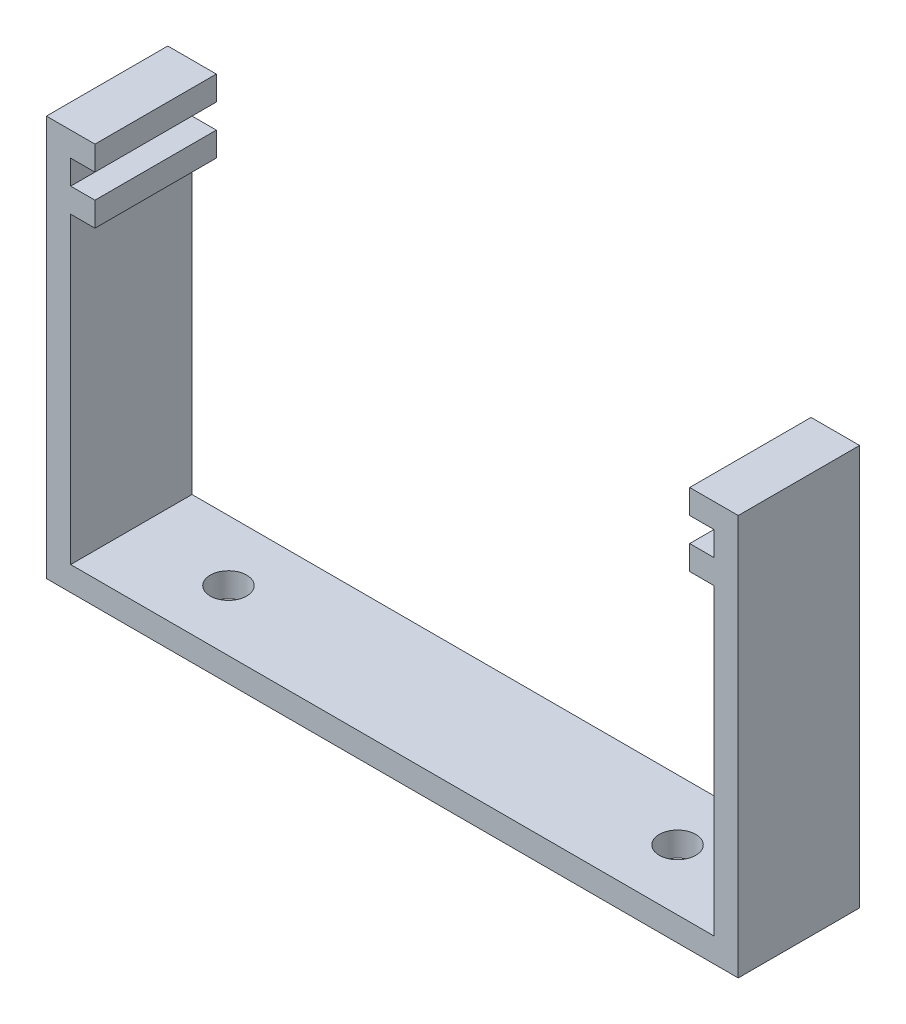
ISO-10303-21;
HEADER;
FILE_DESCRIPTION(('STEP AP214'),'2;1');
FILE_NAME('part.step','',(''),(''),'','','');
FILE_SCHEMA(('AUTOMOTIVE_DESIGN { 1 0 10303 214 1 1 1 1 }'));
ENDSEC;
DATA;
#1=APPLICATION_CONTEXT('core data for automotive mechanical design processes');
#2=APPLICATION_PROTOCOL_DEFINITION('international standard','automotive_design',2000,#1);
#3=PRODUCT_CONTEXT('',#1,'mechanical');
#4=PRODUCT('Part','Part','',(#3));
#5=PRODUCT_RELATED_PRODUCT_CATEGORY('part','',(#4));
#6=PRODUCT_DEFINITION_FORMATION('','',#4);
#7=PRODUCT_DEFINITION_CONTEXT('part definition',#1,'design');
#8=PRODUCT_DEFINITION('design','',#6,#7);
#9=PRODUCT_DEFINITION_SHAPE('','',#8);
#10=(LENGTH_UNIT() NAMED_UNIT(*) SI_UNIT(.MILLI.,.METRE.));
#11=(NAMED_UNIT(*) PLANE_ANGLE_UNIT() SI_UNIT($,.RADIAN.));
#12=(NAMED_UNIT(*) SI_UNIT($,.STERADIAN.) SOLID_ANGLE_UNIT());
#13=UNCERTAINTY_MEASURE_WITH_UNIT(LENGTH_MEASURE(1.E-05),#10,'distance_accuracy_value','');
#14=(GEOMETRIC_REPRESENTATION_CONTEXT(3) GLOBAL_UNCERTAINTY_ASSIGNED_CONTEXT((#13)) GLOBAL_UNIT_ASSIGNED_CONTEXT((#10,
#11,#12)) REPRESENTATION_CONTEXT('',''));
#15=CARTESIAN_POINT('',(0.,0.,0.));
#16=DIRECTION('',(0.,0.,1.));
#17=DIRECTION('',(1.,0.,0.));
#18=AXIS2_PLACEMENT_3D('',#15,#16,#17);
#19=CARTESIAN_POINT('',(0.,0.,10.));
#20=DIRECTION('',(-1.,0.,0.));
#21=DIRECTION('',(0.,0.,1.));
#22=AXIS2_PLACEMENT_3D('',#19,#20,#21);
#23=PLANE('',#22);
#24=DIRECTION('',(0.,1.,0.));
#25=VECTOR('',#24,1.);
#26=CARTESIAN_POINT('',(0.,0.,0.));
#27=LINE('',#26,#25);
#28=CARTESIAN_POINT('',(0.,0.,0.));
#29=VERTEX_POINT('',#28);
#30=CARTESIAN_POINT('',(0.,25.,0.));
#31=VERTEX_POINT('',#30);
#32=EDGE_CURVE('E205',#29,#31,#27,.T.);
#33=ORIENTED_EDGE('',*,*,#32,.T.);
#34=DIRECTION('',(0.,0.,-1.));
#35=VECTOR('',#34,1.);
#36=CARTESIAN_POINT('',(0.,25.,10.));
#37=LINE('',#36,#35);
#38=CARTESIAN_POINT('',(0.,25.,10.));
#39=VERTEX_POINT('',#38);
#40=EDGE_CURVE('E11',#39,#31,#37,.T.);
#41=ORIENTED_EDGE('',*,*,#40,.F.);
#42=DIRECTION('',(0.,1.,0.));
#43=VECTOR('',#42,1.);
#44=CARTESIAN_POINT('',(0.,0.,10.));
#45=LINE('',#44,#43);
#46=CARTESIAN_POINT('',(0.,0.,10.));
#47=VERTEX_POINT('',#46);
#48=EDGE_CURVE('E243',#47,#39,#45,.T.);
#49=ORIENTED_EDGE('',*,*,#48,.F.);
#50=DIRECTION('',(0.,0.,-1.));
#51=VECTOR('',#50,1.);
#52=CARTESIAN_POINT('',(0.,0.,10.));
#53=LINE('',#52,#51);
#54=EDGE_CURVE('E201',#47,#29,#53,.T.);
#55=ORIENTED_EDGE('',*,*,#54,.T.);
#56=EDGE_LOOP('',(#33,#41,#49,#55));
#57=FACE_BOUND('',#56,.T.);
#58=ADVANCED_FACE('F35',(#57),#23,.F.);
#59=CARTESIAN_POINT('',(0.,25.,10.));
#60=DIRECTION('',(0.,1.,0.));
#61=DIRECTION('',(0.,0.,1.));
#62=AXIS2_PLACEMENT_3D('',#59,#60,#61);
#63=PLANE('',#62);
#64=DIRECTION('',(1.,0.,0.));
#65=VECTOR('',#64,1.);
#66=CARTESIAN_POINT('',(0.,25.,0.));
#67=LINE('',#66,#65);
#68=CARTESIAN_POINT('',(2.,25.,0.));
#69=VERTEX_POINT('',#68);
#70=EDGE_CURVE('E208',#31,#69,#67,.T.);
#71=ORIENTED_EDGE('',*,*,#70,.T.);
#72=DIRECTION('',(0.,0.,-1.));
#73=VECTOR('',#72,1.);
#74=CARTESIAN_POINT('',(2.,25.,10.));
#75=LINE('',#74,#73);
#76=CARTESIAN_POINT('',(2.,25.,10.));
#77=VERTEX_POINT('',#76);
#78=EDGE_CURVE('E44',#77,#69,#75,.T.);
#79=ORIENTED_EDGE('',*,*,#78,.F.);
#80=DIRECTION('',(1.,0.,0.));
#81=VECTOR('',#80,1.);
#82=CARTESIAN_POINT('',(0.,25.,10.));
#83=LINE('',#82,#81);
#84=EDGE_CURVE('E132',#39,#77,#83,.T.);
#85=ORIENTED_EDGE('',*,*,#84,.F.);
#86=ORIENTED_EDGE('',*,*,#40,.T.);
#87=EDGE_LOOP('',(#71,#79,#85,#86));
#88=FACE_BOUND('',#87,.T.);
#89=ADVANCED_FACE('F362',(#88),#63,.F.);
#90=CARTESIAN_POINT('',(2.,25.,10.));
#91=DIRECTION('',(-1.,0.,0.));
#92=DIRECTION('',(0.,0.,1.));
#93=AXIS2_PLACEMENT_3D('',#90,#91,#92);
#94=PLANE('',#93);
#95=DIRECTION('',(0.,1.,0.));
#96=VECTOR('',#95,1.);
#97=CARTESIAN_POINT('',(2.,25.,0.));
#98=LINE('',#97,#96);
#99=CARTESIAN_POINT('',(2.,27.,0.));
#100=VERTEX_POINT('',#99);
#101=EDGE_CURVE('E210',#69,#100,#98,.T.);
#102=ORIENTED_EDGE('',*,*,#101,.T.);
#103=DIRECTION('',(0.,0.,-1.));
#104=VECTOR('',#103,1.);
#105=CARTESIAN_POINT('',(2.,27.,10.));
#106=LINE('',#105,#104);
#107=CARTESIAN_POINT('',(2.,27.,10.));
#108=VERTEX_POINT('',#107);
#109=EDGE_CURVE('E286',#108,#100,#106,.T.);
#110=ORIENTED_EDGE('',*,*,#109,.F.);
#111=DIRECTION('',(0.,1.,0.));
#112=VECTOR('',#111,1.);
#113=CARTESIAN_POINT('',(2.,25.,10.));
#114=LINE('',#113,#112);
#115=EDGE_CURVE('E306',#77,#108,#114,.T.);
#116=ORIENTED_EDGE('',*,*,#115,.F.);
#117=ORIENTED_EDGE('',*,*,#78,.T.);
#118=EDGE_LOOP('',(#102,#110,#116,#117));
#119=FACE_BOUND('',#118,.T.);
#120=ADVANCED_FACE('F366',(#119),#94,.F.);
#121=CARTESIAN_POINT('',(2.,27.,10.));
#122=DIRECTION('',(0.,-1.,0.));
#123=DIRECTION('',(0.,0.,-1.));
#124=AXIS2_PLACEMENT_3D('',#121,#122,#123);
#125=PLANE('',#124);
#126=DIRECTION('',(-1.,0.,0.));
#127=VECTOR('',#126,1.);
#128=CARTESIAN_POINT('',(2.,27.,0.));
#129=LINE('',#128,#127);
#130=CARTESIAN_POINT('',(0.,27.,0.));
#131=VERTEX_POINT('',#130);
#132=EDGE_CURVE('E212',#100,#131,#129,.T.);
#133=ORIENTED_EDGE('',*,*,#132,.T.);
#134=DIRECTION('',(0.,0.,-1.));
#135=VECTOR('',#134,1.);
#136=CARTESIAN_POINT('',(0.,27.,10.));
#137=LINE('',#136,#135);
#138=CARTESIAN_POINT('',(0.,27.,10.));
#139=VERTEX_POINT('',#138);
#140=EDGE_CURVE('E283',#139,#131,#137,.T.);
#141=ORIENTED_EDGE('',*,*,#140,.F.);
#142=DIRECTION('',(-1.,0.,0.));
#143=VECTOR('',#142,1.);
#144=CARTESIAN_POINT('',(2.,27.,10.));
#145=LINE('',#144,#143);
#146=EDGE_CURVE('E308',#108,#139,#145,.T.);
#147=ORIENTED_EDGE('',*,*,#146,.F.);
#148=ORIENTED_EDGE('',*,*,#109,.T.);
#149=EDGE_LOOP('',(#133,#141,#147,#148));
#150=FACE_BOUND('',#149,.T.);
#151=ADVANCED_FACE('F370',(#150),#125,.F.);
#152=CARTESIAN_POINT('',(0.,27.,10.));
#153=DIRECTION('',(-1.,0.,0.));
#154=DIRECTION('',(0.,0.,1.));
#155=AXIS2_PLACEMENT_3D('',#152,#153,#154);
#156=PLANE('',#155);
#157=DIRECTION('',(0.,1.,0.));
#158=VECTOR('',#157,1.);
#159=CARTESIAN_POINT('',(0.,27.,0.));
#160=LINE('',#159,#158);
#161=CARTESIAN_POINT('',(0.,29.,0.));
#162=VERTEX_POINT('',#161);
#163=EDGE_CURVE('E214',#131,#162,#160,.T.);
#164=ORIENTED_EDGE('',*,*,#163,.T.);
#165=DIRECTION('',(0.,0.,-1.));
#166=VECTOR('',#165,1.);
#167=CARTESIAN_POINT('',(0.,29.,10.));
#168=LINE('',#167,#166);
#169=CARTESIAN_POINT('',(0.,29.,10.));
#170=VERTEX_POINT('',#169);
#171=EDGE_CURVE('E280',#170,#162,#168,.T.);
#172=ORIENTED_EDGE('',*,*,#171,.F.);
#173=DIRECTION('',(0.,1.,0.));
#174=VECTOR('',#173,1.);
#175=CARTESIAN_POINT('',(0.,27.,10.));
#176=LINE('',#175,#174);
#177=EDGE_CURVE('E310',#139,#170,#176,.T.);
#178=ORIENTED_EDGE('',*,*,#177,.F.);
#179=ORIENTED_EDGE('',*,*,#140,.T.);
#180=EDGE_LOOP('',(#164,#172,#178,#179));
#181=FACE_BOUND('',#180,.T.);
#182=ADVANCED_FACE('F376',(#181),#156,.F.);
#183=CARTESIAN_POINT('',(0.,29.,10.));
#184=DIRECTION('',(0.,1.,0.));
#185=DIRECTION('',(0.,0.,1.));
#186=AXIS2_PLACEMENT_3D('',#183,#184,#185);
#187=PLANE('',#186);
#188=DIRECTION('',(1.,0.,0.));
#189=VECTOR('',#188,1.);
#190=CARTESIAN_POINT('',(0.,29.,0.));
#191=LINE('',#190,#189);
#192=CARTESIAN_POINT('',(2.,29.,0.));
#193=VERTEX_POINT('',#192);
#194=EDGE_CURVE('E216',#162,#193,#191,.T.);
#195=ORIENTED_EDGE('',*,*,#194,.T.);
#196=DIRECTION('',(0.,0.,-1.));
#197=VECTOR('',#196,1.);
#198=CARTESIAN_POINT('',(2.,29.,10.));
#199=LINE('',#198,#197);
#200=CARTESIAN_POINT('',(2.,29.,10.));
#201=VERTEX_POINT('',#200);
#202=EDGE_CURVE('E277',#201,#193,#199,.T.);
#203=ORIENTED_EDGE('',*,*,#202,.F.);
#204=DIRECTION('',(1.,0.,0.));
#205=VECTOR('',#204,1.);
#206=CARTESIAN_POINT('',(0.,29.,10.));
#207=LINE('',#206,#205);
#208=EDGE_CURVE('E312',#170,#201,#207,.T.);
#209=ORIENTED_EDGE('',*,*,#208,.F.);
#210=ORIENTED_EDGE('',*,*,#171,.T.);
#211=EDGE_LOOP('',(#195,#203,#209,#210));
#212=FACE_BOUND('',#211,.T.);
#213=ADVANCED_FACE('F380',(#212),#187,.F.);
#214=CARTESIAN_POINT('',(2.,29.,10.));
#215=DIRECTION('',(-1.,0.,0.));
#216=DIRECTION('',(0.,0.,1.));
#217=AXIS2_PLACEMENT_3D('',#214,#215,#216);
#218=PLANE('',#217);
#219=DIRECTION('',(0.,1.,0.));
#220=VECTOR('',#219,1.);
#221=CARTESIAN_POINT('',(2.,29.,0.));
#222=LINE('',#221,#220);
#223=CARTESIAN_POINT('',(2.,31.,0.));
#224=VERTEX_POINT('',#223);
#225=EDGE_CURVE('E218',#193,#224,#222,.T.);
#226=ORIENTED_EDGE('',*,*,#225,.T.);
#227=DIRECTION('',(0.,0.,-1.));
#228=VECTOR('',#227,1.);
#229=CARTESIAN_POINT('',(2.,31.,10.));
#230=LINE('',#229,#228);
#231=CARTESIAN_POINT('',(2.,31.,10.));
#232=VERTEX_POINT('',#231);
#233=EDGE_CURVE('E274',#232,#224,#230,.T.);
#234=ORIENTED_EDGE('',*,*,#233,.F.);
#235=DIRECTION('',(0.,1.,0.));
#236=VECTOR('',#235,1.);
#237=CARTESIAN_POINT('',(2.,29.,10.));
#238=LINE('',#237,#236);
#239=EDGE_CURVE('E314',#201,#232,#238,.T.);
#240=ORIENTED_EDGE('',*,*,#239,.F.);
#241=ORIENTED_EDGE('',*,*,#202,.T.);
#242=EDGE_LOOP('',(#226,#234,#240,#241));
#243=FACE_BOUND('',#242,.T.);
#244=ADVANCED_FACE('F384',(#243),#218,.F.);
#245=CARTESIAN_POINT('',(2.,31.,10.));
#246=DIRECTION('',(0.,-1.,0.));
#247=DIRECTION('',(0.,0.,-1.));
#248=AXIS2_PLACEMENT_3D('',#245,#246,#247);
#249=PLANE('',#248);
#250=DIRECTION('',(-1.,0.,0.));
#251=VECTOR('',#250,1.);
#252=CARTESIAN_POINT('',(2.,31.,0.));
#253=LINE('',#252,#251);
#254=CARTESIAN_POINT('',(-1.99999999999999,31.,0.));
#255=VERTEX_POINT('',#254);
#256=EDGE_CURVE('E220',#224,#255,#253,.T.);
#257=ORIENTED_EDGE('',*,*,#256,.T.);
#258=DIRECTION('',(0.,0.,-1.));
#259=VECTOR('',#258,1.);
#260=CARTESIAN_POINT('',(-1.99999999999999,31.,10.));
#261=LINE('',#260,#259);
#262=CARTESIAN_POINT('',(-1.99999999999999,31.,10.));
#263=VERTEX_POINT('',#262);
#264=EDGE_CURVE('E271',#263,#255,#261,.T.);
#265=ORIENTED_EDGE('',*,*,#264,.F.);
#266=DIRECTION('',(-1.,0.,0.));
#267=VECTOR('',#266,1.);
#268=CARTESIAN_POINT('',(2.,31.,10.));
#269=LINE('',#268,#267);
#270=EDGE_CURVE('E316',#232,#263,#269,.T.);
#271=ORIENTED_EDGE('',*,*,#270,.F.);
#272=ORIENTED_EDGE('',*,*,#233,.T.);
#273=EDGE_LOOP('',(#257,#265,#271,#272));
#274=FACE_BOUND('',#273,.T.);
#275=ADVANCED_FACE('F388',(#274),#249,.F.);
#276=CARTESIAN_POINT('',(-1.99999999999999,31.,10.));
#277=DIRECTION('',(1.,0.,0.));
#278=DIRECTION('',(0.,1.,0.));
#279=AXIS2_PLACEMENT_3D('',#276,#277,#278);
#280=PLANE('',#279);
#281=DIRECTION('',(0.,-1.,0.));
#282=VECTOR('',#281,1.);
#283=CARTESIAN_POINT('',(-1.99999999999999,31.,0.));
#284=LINE('',#283,#282);
#285=CARTESIAN_POINT('',(-2.,-2.,0.));
#286=VERTEX_POINT('',#285);
#287=EDGE_CURVE('E222',#255,#286,#284,.T.);
#288=ORIENTED_EDGE('',*,*,#287,.T.);
#289=DIRECTION('',(0.,0.,-1.));
#290=VECTOR('',#289,1.);
#291=CARTESIAN_POINT('',(-2.,-2.,10.));
#292=LINE('',#291,#290);
#293=CARTESIAN_POINT('',(-2.,-2.,10.));
#294=VERTEX_POINT('',#293);
#295=EDGE_CURVE('E268',#294,#286,#292,.T.);
#296=ORIENTED_EDGE('',*,*,#295,.F.);
#297=DIRECTION('',(0.,-1.,0.));
#298=VECTOR('',#297,1.);
#299=CARTESIAN_POINT('',(-1.99999999999999,31.,10.));
#300=LINE('',#299,#298);
#301=EDGE_CURVE('E318',#263,#294,#300,.T.);
#302=ORIENTED_EDGE('',*,*,#301,.F.);
#303=ORIENTED_EDGE('',*,*,#264,.T.);
#304=EDGE_LOOP('',(#288,#296,#302,#303));
#305=FACE_BOUND('',#304,.T.);
#306=ADVANCED_FACE('F392',(#305),#280,.F.);
#307=CARTESIAN_POINT('',(55.,-2.,10.));
#308=DIRECTION('',(0.,1.,0.));
#309=DIRECTION('',(0.,0.,1.));
#310=AXIS2_PLACEMENT_3D('',#307,#308,#309);
#311=PLANE('',#310);
#312=CARTESIAN_POINT('',(45.,-2.,5.));
#313=DIRECTION('',(0.,-1.,0.));
#314=DIRECTION('',(0.,0.,-1.));
#315=AXIS2_PLACEMENT_3D('',#312,#313,#314);
#316=CIRCLE('',#315,1.5);
#317=CARTESIAN_POINT('',(45.,-2.,3.5));
#318=VERTEX_POINT('',#317);
#319=EDGE_CURVE('E292',#318,#318,#316,.T.);
#320=ORIENTED_EDGE('',*,*,#319,.F.);
#321=EDGE_LOOP('',(#320));
#322=FACE_BOUND('',#321,.T.);
#323=CARTESIAN_POINT('',(8.,-2.,5.));
#324=DIRECTION('',(0.,-1.,0.));
#325=DIRECTION('',(0.,0.,-1.));
#326=AXIS2_PLACEMENT_3D('',#323,#324,#325);
#327=CIRCLE('',#326,1.5);
#328=CARTESIAN_POINT('',(8.,-2.,3.5));
#329=VERTEX_POINT('',#328);
#330=EDGE_CURVE('E297',#329,#329,#327,.T.);
#331=ORIENTED_EDGE('',*,*,#330,.F.);
#332=EDGE_LOOP('',(#331));
#333=FACE_BOUND('',#332,.T.);
#334=DIRECTION('',(1.,0.,0.));
#335=VECTOR('',#334,1.);
#336=CARTESIAN_POINT('',(55.,-2.,0.));
#337=LINE('',#336,#335);
#338=CARTESIAN_POINT('',(55.,-2.,0.));
#339=VERTEX_POINT('',#338);
#340=EDGE_CURVE('E224',#286,#339,#337,.T.);
#341=ORIENTED_EDGE('',*,*,#340,.T.);
#342=DIRECTION('',(0.,0.,-1.));
#343=VECTOR('',#342,1.);
#344=CARTESIAN_POINT('',(55.,-2.,10.));
#345=LINE('',#344,#343);
#346=CARTESIAN_POINT('',(55.,-2.,10.));
#347=VERTEX_POINT('',#346);
#348=EDGE_CURVE('E265',#347,#339,#345,.T.);
#349=ORIENTED_EDGE('',*,*,#348,.F.);
#350=DIRECTION('',(1.,0.,0.));
#351=VECTOR('',#350,1.);
#352=CARTESIAN_POINT('',(55.,-2.,10.));
#353=LINE('',#352,#351);
#354=EDGE_CURVE('E320',#294,#347,#353,.T.);
#355=ORIENTED_EDGE('',*,*,#354,.F.);
#356=ORIENTED_EDGE('',*,*,#295,.T.);
#357=EDGE_LOOP('',(#341,#349,#355,#356));
#358=FACE_BOUND('',#357,.T.);
#359=ADVANCED_FACE('F396',(#322,#333,#358),#311,.F.);
#360=CARTESIAN_POINT('',(55.,31.,10.));
#361=DIRECTION('',(-1.,0.,0.));
#362=DIRECTION('',(0.,-1.,0.));
#363=AXIS2_PLACEMENT_3D('',#360,#361,#362);
#364=PLANE('',#363);
#365=DIRECTION('',(0.,1.,0.));
#366=VECTOR('',#365,1.);
#367=CARTESIAN_POINT('',(55.,31.,0.));
#368=LINE('',#367,#366);
#369=CARTESIAN_POINT('',(55.,31.,0.));
#370=VERTEX_POINT('',#369);
#371=EDGE_CURVE('E226',#339,#370,#368,.T.);
#372=ORIENTED_EDGE('',*,*,#371,.T.);
#373=DIRECTION('',(0.,0.,-1.));
#374=VECTOR('',#373,1.);
#375=CARTESIAN_POINT('',(55.,31.,10.));
#376=LINE('',#375,#374);
#377=CARTESIAN_POINT('',(55.,31.,10.));
#378=VERTEX_POINT('',#377);
#379=EDGE_CURVE('E262',#378,#370,#376,.T.);
#380=ORIENTED_EDGE('',*,*,#379,.F.);
#381=DIRECTION('',(0.,1.,0.));
#382=VECTOR('',#381,1.);
#383=CARTESIAN_POINT('',(55.,31.,10.));
#384=LINE('',#383,#382);
#385=EDGE_CURVE('E322',#347,#378,#384,.T.);
#386=ORIENTED_EDGE('',*,*,#385,.F.);
#387=ORIENTED_EDGE('',*,*,#348,.T.);
#388=EDGE_LOOP('',(#372,#380,#386,#387));
#389=FACE_BOUND('',#388,.T.);
#390=ADVANCED_FACE('F400',(#389),#364,.F.);
#391=CARTESIAN_POINT('',(51.,31.,10.));
#392=DIRECTION('',(0.,-1.,0.));
#393=DIRECTION('',(0.,0.,-1.));
#394=AXIS2_PLACEMENT_3D('',#391,#392,#393);
#395=PLANE('',#394);
#396=DIRECTION('',(-1.,0.,0.));
#397=VECTOR('',#396,1.);
#398=CARTESIAN_POINT('',(51.,31.,0.));
#399=LINE('',#398,#397);
#400=CARTESIAN_POINT('',(51.,31.,0.));
#401=VERTEX_POINT('',#400);
#402=EDGE_CURVE('E228',#370,#401,#399,.T.);
#403=ORIENTED_EDGE('',*,*,#402,.T.);
#404=DIRECTION('',(0.,0.,-1.));
#405=VECTOR('',#404,1.);
#406=CARTESIAN_POINT('',(51.,31.,10.));
#407=LINE('',#406,#405);
#408=CARTESIAN_POINT('',(51.,31.,10.));
#409=VERTEX_POINT('',#408);
#410=EDGE_CURVE('E259',#409,#401,#407,.T.);
#411=ORIENTED_EDGE('',*,*,#410,.F.);
#412=DIRECTION('',(-1.,0.,0.));
#413=VECTOR('',#412,1.);
#414=CARTESIAN_POINT('',(51.,31.,10.));
#415=LINE('',#414,#413);
#416=EDGE_CURVE('E324',#378,#409,#415,.T.);
#417=ORIENTED_EDGE('',*,*,#416,.F.);
#418=ORIENTED_EDGE('',*,*,#379,.T.);
#419=EDGE_LOOP('',(#403,#411,#417,#418));
#420=FACE_BOUND('',#419,.T.);
#421=ADVANCED_FACE('F404',(#420),#395,.F.);
#422=CARTESIAN_POINT('',(51.,29.,10.));
#423=DIRECTION('',(1.,0.,0.));
#424=DIRECTION('',(0.,0.,-1.));
#425=AXIS2_PLACEMENT_3D('',#422,#423,#424);
#426=PLANE('',#425);
#427=DIRECTION('',(0.,-1.,0.));
#428=VECTOR('',#427,1.);
#429=CARTESIAN_POINT('',(51.,29.,0.));
#430=LINE('',#429,#428);
#431=CARTESIAN_POINT('',(51.,29.,0.));
#432=VERTEX_POINT('',#431);
#433=EDGE_CURVE('E230',#401,#432,#430,.T.);
#434=ORIENTED_EDGE('',*,*,#433,.T.);
#435=DIRECTION('',(0.,0.,-1.));
#436=VECTOR('',#435,1.);
#437=CARTESIAN_POINT('',(51.,29.,10.));
#438=LINE('',#437,#436);
#439=CARTESIAN_POINT('',(51.,29.,10.));
#440=VERTEX_POINT('',#439);
#441=EDGE_CURVE('E256',#440,#432,#438,.T.);
#442=ORIENTED_EDGE('',*,*,#441,.F.);
#443=DIRECTION('',(0.,-1.,0.));
#444=VECTOR('',#443,1.);
#445=CARTESIAN_POINT('',(51.,29.,10.));
#446=LINE('',#445,#444);
#447=EDGE_CURVE('E326',#409,#440,#446,.T.);
#448=ORIENTED_EDGE('',*,*,#447,.F.);
#449=ORIENTED_EDGE('',*,*,#410,.T.);
#450=EDGE_LOOP('',(#434,#442,#448,#449));
#451=FACE_BOUND('',#450,.T.);
#452=ADVANCED_FACE('F408',(#451),#426,.F.);
#453=CARTESIAN_POINT('',(53.,29.,10.));
#454=DIRECTION('',(0.,1.,0.));
#455=DIRECTION('',(0.,0.,1.));
#456=AXIS2_PLACEMENT_3D('',#453,#454,#455);
#457=PLANE('',#456);
#458=DIRECTION('',(1.,0.,0.));
#459=VECTOR('',#458,1.);
#460=CARTESIAN_POINT('',(53.,29.,0.));
#461=LINE('',#460,#459);
#462=CARTESIAN_POINT('',(53.,29.,0.));
#463=VERTEX_POINT('',#462);
#464=EDGE_CURVE('E232',#432,#463,#461,.T.);
#465=ORIENTED_EDGE('',*,*,#464,.T.);
#466=DIRECTION('',(0.,0.,-1.));
#467=VECTOR('',#466,1.);
#468=CARTESIAN_POINT('',(53.,29.,10.));
#469=LINE('',#468,#467);
#470=CARTESIAN_POINT('',(53.,29.,10.));
#471=VERTEX_POINT('',#470);
#472=EDGE_CURVE('E253',#471,#463,#469,.T.);
#473=ORIENTED_EDGE('',*,*,#472,.F.);
#474=DIRECTION('',(1.,0.,0.));
#475=VECTOR('',#474,1.);
#476=CARTESIAN_POINT('',(53.,29.,10.));
#477=LINE('',#476,#475);
#478=EDGE_CURVE('E328',#440,#471,#477,.T.);
#479=ORIENTED_EDGE('',*,*,#478,.F.);
#480=ORIENTED_EDGE('',*,*,#441,.T.);
#481=EDGE_LOOP('',(#465,#473,#479,#480));
#482=FACE_BOUND('',#481,.T.);
#483=ADVANCED_FACE('F412',(#482),#457,.F.);
#484=CARTESIAN_POINT('',(53.,27.,10.));
#485=DIRECTION('',(1.,0.,0.));
#486=DIRECTION('',(0.,0.,-1.));
#487=AXIS2_PLACEMENT_3D('',#484,#485,#486);
#488=PLANE('',#487);
#489=DIRECTION('',(0.,-1.,0.));
#490=VECTOR('',#489,1.);
#491=CARTESIAN_POINT('',(53.,27.,0.));
#492=LINE('',#491,#490);
#493=CARTESIAN_POINT('',(53.,27.,0.));
#494=VERTEX_POINT('',#493);
#495=EDGE_CURVE('E234',#463,#494,#492,.T.);
#496=ORIENTED_EDGE('',*,*,#495,.T.);
#497=DIRECTION('',(0.,0.,-1.));
#498=VECTOR('',#497,1.);
#499=CARTESIAN_POINT('',(53.,27.,10.));
#500=LINE('',#499,#498);
#501=CARTESIAN_POINT('',(53.,27.,10.));
#502=VERTEX_POINT('',#501);
#503=EDGE_CURVE('E250',#502,#494,#500,.T.);
#504=ORIENTED_EDGE('',*,*,#503,.F.);
#505=DIRECTION('',(0.,-1.,0.));
#506=VECTOR('',#505,1.);
#507=CARTESIAN_POINT('',(53.,27.,10.));
#508=LINE('',#507,#506);
#509=EDGE_CURVE('E330',#471,#502,#508,.T.);
#510=ORIENTED_EDGE('',*,*,#509,.F.);
#511=ORIENTED_EDGE('',*,*,#472,.T.);
#512=EDGE_LOOP('',(#496,#504,#510,#511));
#513=FACE_BOUND('',#512,.T.);
#514=ADVANCED_FACE('F416',(#513),#488,.F.);
#515=CARTESIAN_POINT('',(51.,27.,10.));
#516=DIRECTION('',(0.,-1.,0.));
#517=DIRECTION('',(0.,0.,-1.));
#518=AXIS2_PLACEMENT_3D('',#515,#516,#517);
#519=PLANE('',#518);
#520=DIRECTION('',(-1.,0.,0.));
#521=VECTOR('',#520,1.);
#522=CARTESIAN_POINT('',(51.,27.,0.));
#523=LINE('',#522,#521);
#524=CARTESIAN_POINT('',(51.,27.,0.));
#525=VERTEX_POINT('',#524);
#526=EDGE_CURVE('E236',#494,#525,#523,.T.);
#527=ORIENTED_EDGE('',*,*,#526,.T.);
#528=DIRECTION('',(0.,0.,-1.));
#529=VECTOR('',#528,1.);
#530=CARTESIAN_POINT('',(51.,27.,10.));
#531=LINE('',#530,#529);
#532=CARTESIAN_POINT('',(51.,27.,10.));
#533=VERTEX_POINT('',#532);
#534=EDGE_CURVE('E247',#533,#525,#531,.T.);
#535=ORIENTED_EDGE('',*,*,#534,.F.);
#536=DIRECTION('',(-1.,0.,0.));
#537=VECTOR('',#536,1.);
#538=CARTESIAN_POINT('',(51.,27.,10.));
#539=LINE('',#538,#537);
#540=EDGE_CURVE('E332',#502,#533,#539,.T.);
#541=ORIENTED_EDGE('',*,*,#540,.F.);
#542=ORIENTED_EDGE('',*,*,#503,.T.);
#543=EDGE_LOOP('',(#527,#535,#541,#542));
#544=FACE_BOUND('',#543,.T.);
#545=ADVANCED_FACE('F338',(#544),#519,.F.);
#546=CARTESIAN_POINT('',(51.,25.,10.));
#547=DIRECTION('',(1.,0.,0.));
#548=DIRECTION('',(0.,0.,-1.));
#549=AXIS2_PLACEMENT_3D('',#546,#547,#548);
#550=PLANE('',#549);
#551=DIRECTION('',(0.,-1.,0.));
#552=VECTOR('',#551,1.);
#553=CARTESIAN_POINT('',(51.,25.,0.));
#554=LINE('',#553,#552);
#555=CARTESIAN_POINT('',(51.,25.,0.));
#556=VERTEX_POINT('',#555);
#557=EDGE_CURVE('E238',#525,#556,#554,.T.);
#558=ORIENTED_EDGE('',*,*,#557,.T.);
#559=DIRECTION('',(0.,0.,-1.));
#560=VECTOR('',#559,1.);
#561=CARTESIAN_POINT('',(51.,25.,10.));
#562=LINE('',#561,#560);
#563=CARTESIAN_POINT('',(51.,25.,10.));
#564=VERTEX_POINT('',#563);
#565=EDGE_CURVE('E196',#564,#556,#562,.T.);
#566=ORIENTED_EDGE('',*,*,#565,.F.);
#567=DIRECTION('',(0.,-1.,0.));
#568=VECTOR('',#567,1.);
#569=CARTESIAN_POINT('',(51.,25.,10.));
#570=LINE('',#569,#568);
#571=EDGE_CURVE('E187',#533,#564,#570,.T.);
#572=ORIENTED_EDGE('',*,*,#571,.F.);
#573=ORIENTED_EDGE('',*,*,#534,.T.);
#574=EDGE_LOOP('',(#558,#566,#572,#573));
#575=FACE_BOUND('',#574,.T.);
#576=ADVANCED_FACE('F342',(#575),#550,.F.);
#577=CARTESIAN_POINT('',(53.,25.,10.));
#578=DIRECTION('',(0.,1.,0.));
#579=DIRECTION('',(0.,0.,1.));
#580=AXIS2_PLACEMENT_3D('',#577,#578,#579);
#581=PLANE('',#580);
#582=DIRECTION('',(1.,0.,0.));
#583=VECTOR('',#582,1.);
#584=CARTESIAN_POINT('',(53.,25.,0.));
#585=LINE('',#584,#583);
#586=CARTESIAN_POINT('',(53.,25.,0.));
#587=VERTEX_POINT('',#586);
#588=EDGE_CURVE('E195',#556,#587,#585,.T.);
#589=ORIENTED_EDGE('',*,*,#588,.T.);
#590=DIRECTION('',(0.,0.,-1.));
#591=VECTOR('',#590,1.);
#592=CARTESIAN_POINT('',(53.,25.,10.));
#593=LINE('',#592,#591);
#594=CARTESIAN_POINT('',(53.,25.,10.));
#595=VERTEX_POINT('',#594);
#596=EDGE_CURVE('E192',#595,#587,#593,.T.);
#597=ORIENTED_EDGE('',*,*,#596,.F.);
#598=DIRECTION('',(1.,0.,0.));
#599=VECTOR('',#598,1.);
#600=CARTESIAN_POINT('',(53.,25.,10.));
#601=LINE('',#600,#599);
#602=EDGE_CURVE('E181',#564,#595,#601,.T.);
#603=ORIENTED_EDGE('',*,*,#602,.F.);
#604=ORIENTED_EDGE('',*,*,#565,.T.);
#605=EDGE_LOOP('',(#589,#597,#603,#604));
#606=FACE_BOUND('',#605,.T.);
#607=ADVANCED_FACE('F193',(#606),#581,.F.);
#608=CARTESIAN_POINT('',(53.,0.,10.));
#609=DIRECTION('',(1.,0.,0.));
#610=DIRECTION('',(0.,0.,-1.));
#611=AXIS2_PLACEMENT_3D('',#608,#609,#610);
#612=PLANE('',#611);
#613=DIRECTION('',(0.,-1.,0.));
#614=VECTOR('',#613,1.);
#615=CARTESIAN_POINT('',(53.,0.,0.));
#616=LINE('',#615,#614);
#617=CARTESIAN_POINT('',(53.,0.,0.));
#618=VERTEX_POINT('',#617);
#619=EDGE_CURVE('E118',#587,#618,#616,.T.);
#620=ORIENTED_EDGE('',*,*,#619,.T.);
#621=DIRECTION('',(0.,0.,-1.));
#622=VECTOR('',#621,1.);
#623=CARTESIAN_POINT('',(53.,0.,10.));
#624=LINE('',#623,#622);
#625=CARTESIAN_POINT('',(53.,0.,10.));
#626=VERTEX_POINT('',#625);
#627=EDGE_CURVE('E197',#626,#618,#624,.T.);
#628=ORIENTED_EDGE('',*,*,#627,.F.);
#629=DIRECTION('',(0.,-1.,0.));
#630=VECTOR('',#629,1.);
#631=CARTESIAN_POINT('',(53.,0.,10.));
#632=LINE('',#631,#630);
#633=EDGE_CURVE('E185',#595,#626,#632,.T.);
#634=ORIENTED_EDGE('',*,*,#633,.F.);
#635=ORIENTED_EDGE('',*,*,#596,.T.);
#636=EDGE_LOOP('',(#620,#628,#634,#635));
#637=FACE_BOUND('',#636,.T.);
#638=ADVANCED_FACE('F199',(#637),#612,.F.);
#639=CARTESIAN_POINT('',(0.,0.,10.));
#640=DIRECTION('',(0.,-1.,0.));
#641=DIRECTION('',(0.,0.,-1.));
#642=AXIS2_PLACEMENT_3D('',#639,#640,#641);
#643=PLANE('',#642);
#644=CARTESIAN_POINT('',(45.,0.,5.));
#645=DIRECTION('',(0.,-1.,0.));
#646=DIRECTION('',(0.,0.,-1.));
#647=AXIS2_PLACEMENT_3D('',#644,#645,#646);
#648=CIRCLE('',#647,1.5);
#649=CARTESIAN_POINT('',(45.,0.,3.5));
#650=VERTEX_POINT('',#649);
#651=EDGE_CURVE('E38',#650,#650,#648,.T.);
#652=ORIENTED_EDGE('',*,*,#651,.T.);
#653=EDGE_LOOP('',(#652));
#654=FACE_BOUND('',#653,.T.);
#655=CARTESIAN_POINT('',(8.,0.,5.));
#656=DIRECTION('',(0.,-1.,0.));
#657=DIRECTION('',(0.,0.,-1.));
#658=AXIS2_PLACEMENT_3D('',#655,#656,#657);
#659=CIRCLE('',#658,1.5);
#660=CARTESIAN_POINT('',(8.,0.,3.5));
#661=VERTEX_POINT('',#660);
#662=EDGE_CURVE('E290',#661,#661,#659,.T.);
#663=ORIENTED_EDGE('',*,*,#662,.T.);
#664=EDGE_LOOP('',(#663));
#665=FACE_BOUND('',#664,.T.);
#666=DIRECTION('',(-1.,0.,0.));
#667=VECTOR('',#666,1.);
#668=CARTESIAN_POINT('',(0.,0.,0.));
#669=LINE('',#668,#667);
#670=EDGE_CURVE('E124',#618,#29,#669,.T.);
#671=ORIENTED_EDGE('',*,*,#670,.T.);
#672=ORIENTED_EDGE('',*,*,#54,.F.);
#673=DIRECTION('',(-1.,0.,0.));
#674=VECTOR('',#673,1.);
#675=CARTESIAN_POINT('',(0.,0.,10.));
#676=LINE('',#675,#674);
#677=EDGE_CURVE('E53',#626,#47,#676,.T.);
#678=ORIENTED_EDGE('',*,*,#677,.F.);
#679=ORIENTED_EDGE('',*,*,#627,.T.);
#680=EDGE_LOOP('',(#671,#672,#678,#679));
#681=FACE_BOUND('',#680,.T.);
#682=ADVANCED_FACE('F350',(#654,#665,#681),#643,.F.);
#683=CARTESIAN_POINT('',(0.,0.,10.));
#684=DIRECTION('',(0.,0.,-1.));
#685=DIRECTION('',(-1.,0.,0.));
#686=AXIS2_PLACEMENT_3D('',#683,#684,#685);
#687=PLANE('',#686);
#688=ORIENTED_EDGE('',*,*,#48,.T.);
#689=ORIENTED_EDGE('',*,*,#84,.T.);
#690=ORIENTED_EDGE('',*,*,#115,.T.);
#691=ORIENTED_EDGE('',*,*,#146,.T.);
#692=ORIENTED_EDGE('',*,*,#177,.T.);
#693=ORIENTED_EDGE('',*,*,#208,.T.);
#694=ORIENTED_EDGE('',*,*,#239,.T.);
#695=ORIENTED_EDGE('',*,*,#270,.T.);
#696=ORIENTED_EDGE('',*,*,#301,.T.);
#697=ORIENTED_EDGE('',*,*,#354,.T.);
#698=ORIENTED_EDGE('',*,*,#385,.T.);
#699=ORIENTED_EDGE('',*,*,#416,.T.);
#700=ORIENTED_EDGE('',*,*,#447,.T.);
#701=ORIENTED_EDGE('',*,*,#478,.T.);
#702=ORIENTED_EDGE('',*,*,#509,.T.);
#703=ORIENTED_EDGE('',*,*,#540,.T.);
#704=ORIENTED_EDGE('',*,*,#571,.T.);
#705=ORIENTED_EDGE('',*,*,#602,.T.);
#706=ORIENTED_EDGE('',*,*,#633,.T.);
#707=ORIENTED_EDGE('',*,*,#677,.T.);
#708=EDGE_LOOP('',(#688,#689,#690,#691,#692,#693,#694,#695,#696,#697,#698,#699,#700,#701,#702,
#703,#704,#705,#706,#707));
#709=FACE_BOUND('',#708,.T.);
#710=ADVANCED_FACE('F183',(#709),#687,.F.);
#711=CARTESIAN_POINT('',(0.,0.,0.));
#712=DIRECTION('',(0.,0.,-1.));
#713=DIRECTION('',(-1.,0.,0.));
#714=AXIS2_PLACEMENT_3D('',#711,#712,#713);
#715=PLANE('',#714);
#716=ORIENTED_EDGE('',*,*,#32,.F.);
#717=ORIENTED_EDGE('',*,*,#670,.F.);
#718=ORIENTED_EDGE('',*,*,#619,.F.);
#719=ORIENTED_EDGE('',*,*,#588,.F.);
#720=ORIENTED_EDGE('',*,*,#557,.F.);
#721=ORIENTED_EDGE('',*,*,#526,.F.);
#722=ORIENTED_EDGE('',*,*,#495,.F.);
#723=ORIENTED_EDGE('',*,*,#464,.F.);
#724=ORIENTED_EDGE('',*,*,#433,.F.);
#725=ORIENTED_EDGE('',*,*,#402,.F.);
#726=ORIENTED_EDGE('',*,*,#371,.F.);
#727=ORIENTED_EDGE('',*,*,#340,.F.);
#728=ORIENTED_EDGE('',*,*,#287,.F.);
#729=ORIENTED_EDGE('',*,*,#256,.F.);
#730=ORIENTED_EDGE('',*,*,#225,.F.);
#731=ORIENTED_EDGE('',*,*,#194,.F.);
#732=ORIENTED_EDGE('',*,*,#163,.F.);
#733=ORIENTED_EDGE('',*,*,#132,.F.);
#734=ORIENTED_EDGE('',*,*,#101,.F.);
#735=ORIENTED_EDGE('',*,*,#70,.F.);
#736=EDGE_LOOP('',(#716,#717,#718,#719,#720,#721,#722,#723,#724,#725,#726,#727,#728,#729,#730,
#731,#732,#733,#734,#735));
#737=FACE_BOUND('',#736,.T.);
#738=ADVANCED_FACE('F345',(#737),#715,.T.);
#739=CARTESIAN_POINT('',(8.,8.,5.));
#740=DIRECTION('',(0.,-1.,0.));
#741=DIRECTION('',(0.,0.,-1.));
#742=AXIS2_PLACEMENT_3D('',#739,#740,#741);
#743=CYLINDRICAL_SURFACE('',#742,1.5);
#744=ORIENTED_EDGE('',*,*,#330,.T.);
#745=EDGE_LOOP('',(#744));
#746=FACE_BOUND('',#745,.T.);
#747=ORIENTED_EDGE('',*,*,#662,.F.);
#748=EDGE_LOOP('',(#747));
#749=FACE_BOUND('',#748,.T.);
#750=ADVANCED_FACE('F450',(#746,#749),#743,.F.);
#751=CARTESIAN_POINT('',(45.,8.,5.));
#752=DIRECTION('',(0.,-1.,0.));
#753=DIRECTION('',(0.,0.,-1.));
#754=AXIS2_PLACEMENT_3D('',#751,#752,#753);
#755=CYLINDRICAL_SURFACE('',#754,1.5);
#756=ORIENTED_EDGE('',*,*,#319,.T.);
#757=EDGE_LOOP('',(#756));
#758=FACE_BOUND('',#757,.T.);
#759=ORIENTED_EDGE('',*,*,#651,.F.);
#760=EDGE_LOOP('',(#759));
#761=FACE_BOUND('',#760,.T.);
#762=ADVANCED_FACE('F469',(#758,#761),#755,.F.);
#763=CLOSED_SHELL('',(#58,#89,#120,#151,#182,#213,#244,#275,#306,#359,#390,#421,#452,#483,#514,
#545,#576,#607,#638,#682,#710,#738,#750,#762));
#764=MANIFOLD_SOLID_BREP('B2',#763);
#765=ADVANCED_BREP_SHAPE_REPRESENTATION('',(#18,#764),#14);
#766=SHAPE_DEFINITION_REPRESENTATION(#9,#765);
ENDSEC;
END-ISO-10303-21;
